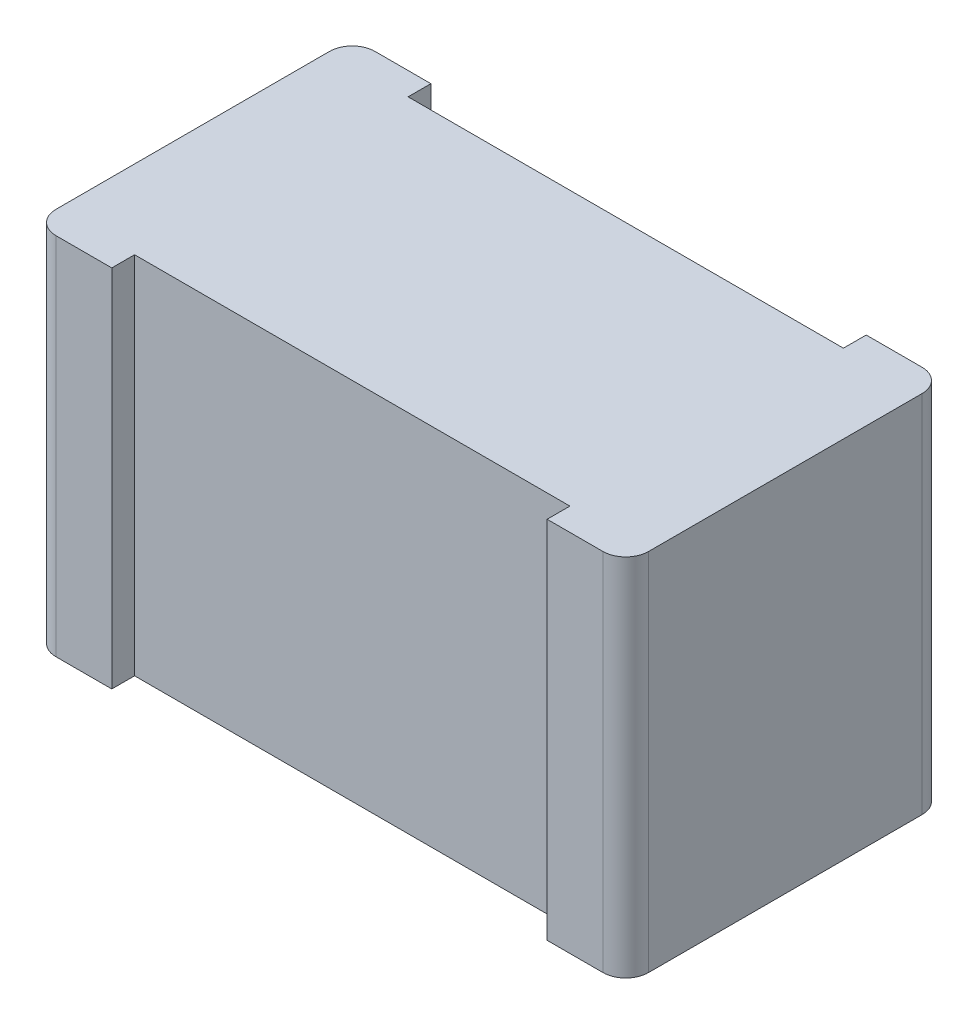
ISO-10303-21;
HEADER;
FILE_DESCRIPTION(('STEP AP214'),'2;1');
FILE_NAME('part.step','',(''),(''),'','','');
FILE_SCHEMA(('AUTOMOTIVE_DESIGN { 1 0 10303 214 1 1 1 1 }'));
ENDSEC;
DATA;
#1=APPLICATION_CONTEXT('core data for automotive mechanical design processes');
#2=APPLICATION_PROTOCOL_DEFINITION('international standard','automotive_design',2000,#1);
#3=PRODUCT_CONTEXT('',#1,'mechanical');
#4=PRODUCT('Part','Part','',(#3));
#5=PRODUCT_RELATED_PRODUCT_CATEGORY('part','',(#4));
#6=PRODUCT_DEFINITION_FORMATION('','',#4);
#7=PRODUCT_DEFINITION_CONTEXT('part definition',#1,'design');
#8=PRODUCT_DEFINITION('design','',#6,#7);
#9=PRODUCT_DEFINITION_SHAPE('','',#8);
#10=(LENGTH_UNIT() NAMED_UNIT(*) SI_UNIT(.MILLI.,.METRE.));
#11=(NAMED_UNIT(*) PLANE_ANGLE_UNIT() SI_UNIT($,.RADIAN.));
#12=(NAMED_UNIT(*) SI_UNIT($,.STERADIAN.) SOLID_ANGLE_UNIT());
#13=UNCERTAINTY_MEASURE_WITH_UNIT(LENGTH_MEASURE(1.E-05),#10,'distance_accuracy_value','');
#14=(GEOMETRIC_REPRESENTATION_CONTEXT(3) GLOBAL_UNCERTAINTY_ASSIGNED_CONTEXT((#13)) GLOBAL_UNIT_ASSIGNED_CONTEXT((#10,
#11,#12)) REPRESENTATION_CONTEXT('',''));
#15=CARTESIAN_POINT('',(0.,0.,0.));
#16=DIRECTION('',(0.,0.,1.));
#17=DIRECTION('',(1.,0.,0.));
#18=AXIS2_PLACEMENT_3D('',#15,#16,#17);
#19=CARTESIAN_POINT('',(0.,0.,7.));
#20=DIRECTION('',(0.,0.,1.));
#21=DIRECTION('',(1.,0.,0.));
#22=AXIS2_PLACEMENT_3D('',#19,#20,#21);
#23=PLANE('',#22);
#24=DIRECTION('',(0.,1.,0.));
#25=VECTOR('',#24,1.);
#26=CARTESIAN_POINT('',(4.775,4.,7.));
#27=LINE('',#26,#25);
#28=CARTESIAN_POINT('',(4.775,4.,7.));
#29=VERTEX_POINT('',#28);
#30=CARTESIAN_POINT('',(4.775,-4.,7.));
#31=VERTEX_POINT('',#30);
#32=EDGE_CURVE('E162',#29,#31,#27,.F.);
#33=ORIENTED_EDGE('',*,*,#32,.T.);
#34=DIRECTION('',(1.,0.,0.));
#35=VECTOR('',#34,1.);
#36=CARTESIAN_POINT('',(0.,-4.,7.));
#37=LINE('',#36,#35);
#38=CARTESIAN_POINT('',(6.,-4.,7.));
#39=VERTEX_POINT('',#38);
#40=EDGE_CURVE('E184',#31,#39,#37,.T.);
#41=ORIENTED_EDGE('',*,*,#40,.T.);
#42=DIRECTION('',(0.,-1.,0.));
#43=VECTOR('',#42,1.);
#44=CARTESIAN_POINT('',(6.,2.,7.));
#45=LINE('',#44,#43);
#46=CARTESIAN_POINT('',(6.,4.,7.));
#47=VERTEX_POINT('',#46);
#48=EDGE_CURVE('E151',#47,#39,#45,.T.);
#49=ORIENTED_EDGE('',*,*,#48,.F.);
#50=DIRECTION('',(1.,0.,0.));
#51=VECTOR('',#50,1.);
#52=CARTESIAN_POINT('',(0.,4.,7.));
#53=LINE('',#52,#51);
#54=EDGE_CURVE('E186',#47,#29,#53,.F.);
#55=ORIENTED_EDGE('',*,*,#54,.T.);
#56=EDGE_LOOP('',(#33,#41,#49,#55));
#57=FACE_BOUND('',#56,.T.);
#58=ADVANCED_FACE('F17',(#57),#23,.T.);
#59=CARTESIAN_POINT('',(0.,0.,0.));
#60=DIRECTION('',(0.,0.,1.));
#61=DIRECTION('',(1.,0.,0.));
#62=AXIS2_PLACEMENT_3D('',#59,#60,#61);
#63=PLANE('',#62);
#64=DIRECTION('',(1.,0.,0.));
#65=VECTOR('',#64,1.);
#66=CARTESIAN_POINT('',(0.,-4.,0.));
#67=LINE('',#66,#65);
#68=CARTESIAN_POINT('',(4.775,-4.,0.));
#69=VERTEX_POINT('',#68);
#70=CARTESIAN_POINT('',(6.,-4.,0.));
#71=VERTEX_POINT('',#70);
#72=EDGE_CURVE('E124',#69,#71,#67,.T.);
#73=ORIENTED_EDGE('',*,*,#72,.F.);
#74=DIRECTION('',(0.,1.,0.));
#75=VECTOR('',#74,1.);
#76=CARTESIAN_POINT('',(4.775,4.,0.));
#77=LINE('',#76,#75);
#78=CARTESIAN_POINT('',(4.775,4.,0.));
#79=VERTEX_POINT('',#78);
#80=EDGE_CURVE('E155',#69,#79,#77,.T.);
#81=ORIENTED_EDGE('',*,*,#80,.T.);
#82=DIRECTION('',(1.,0.,0.));
#83=VECTOR('',#82,1.);
#84=CARTESIAN_POINT('',(0.,4.,0.));
#85=LINE('',#84,#83);
#86=CARTESIAN_POINT('',(6.,4.,0.));
#87=VERTEX_POINT('',#86);
#88=EDGE_CURVE('E69',#87,#79,#85,.F.);
#89=ORIENTED_EDGE('',*,*,#88,.F.);
#90=DIRECTION('',(0.,-1.,0.));
#91=VECTOR('',#90,1.);
#92=CARTESIAN_POINT('',(6.,2.,0.));
#93=LINE('',#92,#91);
#94=EDGE_CURVE('E158',#71,#87,#93,.F.);
#95=ORIENTED_EDGE('',*,*,#94,.F.);
#96=EDGE_LOOP('',(#73,#81,#89,#95));
#97=FACE_BOUND('',#96,.T.);
#98=ADVANCED_FACE('F315',(#97),#63,.F.);
#99=CARTESIAN_POINT('',(0.,0.,7.));
#100=DIRECTION('',(0.,0.,1.));
#101=DIRECTION('',(1.,0.,0.));
#102=AXIS2_PLACEMENT_3D('',#99,#100,#101);
#103=PLANE('',#102);
#104=DIRECTION('',(0.,1.,0.));
#105=VECTOR('',#104,1.);
#106=CARTESIAN_POINT('',(-4.775,4.,7.));
#107=LINE('',#106,#105);
#108=CARTESIAN_POINT('',(-4.775,-4.,7.));
#109=VERTEX_POINT('',#108);
#110=CARTESIAN_POINT('',(-4.775,4.,7.));
#111=VERTEX_POINT('',#110);
#112=EDGE_CURVE('E176',#109,#111,#107,.T.);
#113=ORIENTED_EDGE('',*,*,#112,.T.);
#114=DIRECTION('',(1.,0.,0.));
#115=VECTOR('',#114,1.);
#116=CARTESIAN_POINT('',(0.,4.,7.));
#117=LINE('',#116,#115);
#118=CARTESIAN_POINT('',(-6.,4.,7.));
#119=VERTEX_POINT('',#118);
#120=EDGE_CURVE('E123',#111,#119,#117,.F.);
#121=ORIENTED_EDGE('',*,*,#120,.T.);
#122=DIRECTION('',(0.,1.,0.));
#123=VECTOR('',#122,1.);
#124=CARTESIAN_POINT('',(-6.,-2.,7.));
#125=LINE('',#124,#123);
#126=CARTESIAN_POINT('',(-6.,-4.,7.));
#127=VERTEX_POINT('',#126);
#128=EDGE_CURVE('E128',#127,#119,#125,.T.);
#129=ORIENTED_EDGE('',*,*,#128,.F.);
#130=DIRECTION('',(1.,0.,0.));
#131=VECTOR('',#130,1.);
#132=CARTESIAN_POINT('',(0.,-4.,7.));
#133=LINE('',#132,#131);
#134=EDGE_CURVE('E109',#127,#109,#133,.T.);
#135=ORIENTED_EDGE('',*,*,#134,.T.);
#136=EDGE_LOOP('',(#113,#121,#129,#135));
#137=FACE_BOUND('',#136,.T.);
#138=ADVANCED_FACE('F129',(#137),#103,.T.);
#139=CARTESIAN_POINT('',(0.,0.,0.));
#140=DIRECTION('',(0.,0.,1.));
#141=DIRECTION('',(1.,0.,0.));
#142=AXIS2_PLACEMENT_3D('',#139,#140,#141);
#143=PLANE('',#142);
#144=DIRECTION('',(1.,0.,0.));
#145=VECTOR('',#144,1.);
#146=CARTESIAN_POINT('',(0.,4.,0.));
#147=LINE('',#146,#145);
#148=CARTESIAN_POINT('',(-4.775,4.,0.));
#149=VERTEX_POINT('',#148);
#150=CARTESIAN_POINT('',(-6.,4.,0.));
#151=VERTEX_POINT('',#150);
#152=EDGE_CURVE('E172',#149,#151,#147,.F.);
#153=ORIENTED_EDGE('',*,*,#152,.F.);
#154=DIRECTION('',(0.,1.,0.));
#155=VECTOR('',#154,1.);
#156=CARTESIAN_POINT('',(-4.775,4.,0.));
#157=LINE('',#156,#155);
#158=CARTESIAN_POINT('',(-4.775,-4.,0.));
#159=VERTEX_POINT('',#158);
#160=EDGE_CURVE('E148',#149,#159,#157,.F.);
#161=ORIENTED_EDGE('',*,*,#160,.T.);
#162=DIRECTION('',(1.,0.,0.));
#163=VECTOR('',#162,1.);
#164=CARTESIAN_POINT('',(0.,-4.,0.));
#165=LINE('',#164,#163);
#166=CARTESIAN_POINT('',(-6.,-4.,0.));
#167=VERTEX_POINT('',#166);
#168=EDGE_CURVE('E169',#167,#159,#165,.T.);
#169=ORIENTED_EDGE('',*,*,#168,.F.);
#170=DIRECTION('',(0.,1.,0.));
#171=VECTOR('',#170,1.);
#172=CARTESIAN_POINT('',(-6.,-2.,0.));
#173=LINE('',#172,#171);
#174=EDGE_CURVE('E138',#151,#167,#173,.F.);
#175=ORIENTED_EDGE('',*,*,#174,.F.);
#176=EDGE_LOOP('',(#153,#161,#169,#175));
#177=FACE_BOUND('',#176,.T.);
#178=ADVANCED_FACE('F323',(#177),#143,.F.);
#179=CARTESIAN_POINT('',(-4.775,4.,6.5));
#180=DIRECTION('',(-1.,0.,0.));
#181=DIRECTION('',(0.,0.,1.));
#182=AXIS2_PLACEMENT_3D('',#179,#180,#181);
#183=PLANE('',#182);
#184=DIRECTION('',(0.,1.,0.));
#185=VECTOR('',#184,1.);
#186=CARTESIAN_POINT('',(-4.775,4.,6.5));
#187=LINE('',#186,#185);
#188=CARTESIAN_POINT('',(-4.775,-4.,6.5));
#189=VERTEX_POINT('',#188);
#190=CARTESIAN_POINT('',(-4.775,4.,6.5));
#191=VERTEX_POINT('',#190);
#192=EDGE_CURVE('E222',#189,#191,#187,.T.);
#193=ORIENTED_EDGE('',*,*,#192,.T.);
#194=DIRECTION('',(0.,0.,1.));
#195=VECTOR('',#194,1.);
#196=CARTESIAN_POINT('',(-4.775,4.,6.5));
#197=LINE('',#196,#195);
#198=EDGE_CURVE('E214',#111,#191,#197,.F.);
#199=ORIENTED_EDGE('',*,*,#198,.F.);
#200=ORIENTED_EDGE('',*,*,#112,.F.);
#201=DIRECTION('',(0.,0.,-1.));
#202=VECTOR('',#201,1.);
#203=CARTESIAN_POINT('',(-4.775,-4.,0.));
#204=LINE('',#203,#202);
#205=EDGE_CURVE('E119',#189,#109,#204,.F.);
#206=ORIENTED_EDGE('',*,*,#205,.F.);
#207=EDGE_LOOP('',(#193,#199,#200,#206));
#208=FACE_BOUND('',#207,.T.);
#209=ADVANCED_FACE('F332',(#208),#183,.F.);
#210=CARTESIAN_POINT('',(4.775,4.,7.));
#211=DIRECTION('',(1.,0.,0.));
#212=DIRECTION('',(0.,0.,-1.));
#213=AXIS2_PLACEMENT_3D('',#210,#211,#212);
#214=PLANE('',#213);
#215=ORIENTED_EDGE('',*,*,#32,.F.);
#216=DIRECTION('',(0.,0.,-1.));
#217=VECTOR('',#216,1.);
#218=CARTESIAN_POINT('',(4.775,4.,7.));
#219=LINE('',#218,#217);
#220=CARTESIAN_POINT('',(4.775,4.,6.5));
#221=VERTEX_POINT('',#220);
#222=EDGE_CURVE('E76',#221,#29,#219,.F.);
#223=ORIENTED_EDGE('',*,*,#222,.F.);
#224=DIRECTION('',(0.,1.,0.));
#225=VECTOR('',#224,1.);
#226=CARTESIAN_POINT('',(4.775,4.,6.5));
#227=LINE('',#226,#225);
#228=CARTESIAN_POINT('',(4.775,-4.,6.5));
#229=VERTEX_POINT('',#228);
#230=EDGE_CURVE('E273',#221,#229,#227,.F.);
#231=ORIENTED_EDGE('',*,*,#230,.T.);
#232=DIRECTION('',(0.,0.,-1.));
#233=VECTOR('',#232,1.);
#234=CARTESIAN_POINT('',(4.775,-4.,0.));
#235=LINE('',#234,#233);
#236=EDGE_CURVE('E223',#31,#229,#235,.T.);
#237=ORIENTED_EDGE('',*,*,#236,.F.);
#238=EDGE_LOOP('',(#215,#223,#231,#237));
#239=FACE_BOUND('',#238,.T.);
#240=ADVANCED_FACE('F342',(#239),#214,.F.);
#241=CARTESIAN_POINT('',(6.,2.,0.5));
#242=DIRECTION('',(0.,-1.,0.));
#243=DIRECTION('',(0.,0.,-1.));
#244=AXIS2_PLACEMENT_3D('',#241,#242,#243);
#245=CYLINDRICAL_SURFACE('',#244,0.5);
#246=CARTESIAN_POINT('',(6.,4.,0.5));
#247=DIRECTION('',(0.,-1.,0.));
#248=DIRECTION('',(0.,0.,-1.));
#249=AXIS2_PLACEMENT_3D('',#246,#247,#248);
#250=CIRCLE('',#249,0.5);
#251=CARTESIAN_POINT('',(6.5,4.,0.5));
#252=VERTEX_POINT('',#251);
#253=EDGE_CURVE('E20',#87,#252,#250,.T.);
#254=ORIENTED_EDGE('',*,*,#253,.T.);
#255=DIRECTION('',(0.,1.,0.));
#256=VECTOR('',#255,1.);
#257=CARTESIAN_POINT('',(6.5,4.,0.5));
#258=LINE('',#257,#256);
#259=CARTESIAN_POINT('',(6.5,-4.,0.5));
#260=VERTEX_POINT('',#259);
#261=EDGE_CURVE('E258',#260,#252,#258,.T.);
#262=ORIENTED_EDGE('',*,*,#261,.F.);
#263=CARTESIAN_POINT('',(6.,-4.,0.5));
#264=DIRECTION('',(0.,-1.,0.));
#265=DIRECTION('',(0.,0.,-1.));
#266=AXIS2_PLACEMENT_3D('',#263,#264,#265);
#267=CIRCLE('',#266,0.5);
#268=EDGE_CURVE('E231',#71,#260,#267,.T.);
#269=ORIENTED_EDGE('',*,*,#268,.F.);
#270=ORIENTED_EDGE('',*,*,#94,.T.);
#271=EDGE_LOOP('',(#254,#262,#269,#270));
#272=FACE_BOUND('',#271,.T.);
#273=ADVANCED_FACE('F348',(#272),#245,.T.);
#274=CARTESIAN_POINT('',(6.,2.,6.5));
#275=DIRECTION('',(0.,-1.,0.));
#276=DIRECTION('',(0.,0.,-1.));
#277=AXIS2_PLACEMENT_3D('',#274,#275,#276);
#278=CYLINDRICAL_SURFACE('',#277,0.5);
#279=CARTESIAN_POINT('',(6.,4.,6.5));
#280=DIRECTION('',(0.,-1.,0.));
#281=DIRECTION('',(0.,0.,-1.));
#282=AXIS2_PLACEMENT_3D('',#279,#280,#281);
#283=CIRCLE('',#282,0.5);
#284=CARTESIAN_POINT('',(6.5,4.,6.5));
#285=VERTEX_POINT('',#284);
#286=EDGE_CURVE('E149',#285,#47,#283,.T.);
#287=ORIENTED_EDGE('',*,*,#286,.T.);
#288=ORIENTED_EDGE('',*,*,#48,.T.);
#289=CARTESIAN_POINT('',(6.,-4.,6.5));
#290=DIRECTION('',(0.,-1.,0.));
#291=DIRECTION('',(0.,0.,-1.));
#292=AXIS2_PLACEMENT_3D('',#289,#290,#291);
#293=CIRCLE('',#292,0.5);
#294=CARTESIAN_POINT('',(6.5,-4.,6.5));
#295=VERTEX_POINT('',#294);
#296=EDGE_CURVE('E242',#295,#39,#293,.T.);
#297=ORIENTED_EDGE('',*,*,#296,.F.);
#298=DIRECTION('',(0.,1.,0.));
#299=VECTOR('',#298,1.);
#300=CARTESIAN_POINT('',(6.5,4.,6.5));
#301=LINE('',#300,#299);
#302=EDGE_CURVE('E260',#285,#295,#301,.F.);
#303=ORIENTED_EDGE('',*,*,#302,.F.);
#304=EDGE_LOOP('',(#287,#288,#297,#303));
#305=FACE_BOUND('',#304,.T.);
#306=ADVANCED_FACE('F346',(#305),#278,.T.);
#307=CARTESIAN_POINT('',(4.775,4.,0.500000000000001));
#308=DIRECTION('',(1.,0.,0.));
#309=DIRECTION('',(0.,0.,-1.));
#310=AXIS2_PLACEMENT_3D('',#307,#308,#309);
#311=PLANE('',#310);
#312=DIRECTION('',(0.,1.,0.));
#313=VECTOR('',#312,1.);
#314=CARTESIAN_POINT('',(4.775,4.,0.500000000000001));
#315=LINE('',#314,#313);
#316=CARTESIAN_POINT('',(4.775,-4.,0.500000000000001));
#317=VERTEX_POINT('',#316);
#318=CARTESIAN_POINT('',(4.775,4.,0.500000000000001));
#319=VERTEX_POINT('',#318);
#320=EDGE_CURVE('E261',#317,#319,#315,.T.);
#321=ORIENTED_EDGE('',*,*,#320,.T.);
#322=DIRECTION('',(0.,0.,-1.));
#323=VECTOR('',#322,1.);
#324=CARTESIAN_POINT('',(4.775,4.,0.500000000000001));
#325=LINE('',#324,#323);
#326=EDGE_CURVE('E201',#79,#319,#325,.F.);
#327=ORIENTED_EDGE('',*,*,#326,.F.);
#328=ORIENTED_EDGE('',*,*,#80,.F.);
#329=DIRECTION('',(0.,0.,-1.));
#330=VECTOR('',#329,1.);
#331=CARTESIAN_POINT('',(4.775,-4.,0.));
#332=LINE('',#331,#330);
#333=EDGE_CURVE('E210',#317,#69,#332,.T.);
#334=ORIENTED_EDGE('',*,*,#333,.F.);
#335=EDGE_LOOP('',(#321,#327,#328,#334));
#336=FACE_BOUND('',#335,.T.);
#337=ADVANCED_FACE('F317',(#336),#311,.F.);
#338=CARTESIAN_POINT('',(-4.775,4.,0.));
#339=DIRECTION('',(-1.,0.,0.));
#340=DIRECTION('',(0.,0.,1.));
#341=AXIS2_PLACEMENT_3D('',#338,#339,#340);
#342=PLANE('',#341);
#343=ORIENTED_EDGE('',*,*,#160,.F.);
#344=DIRECTION('',(0.,0.,1.));
#345=VECTOR('',#344,1.);
#346=CARTESIAN_POINT('',(-4.775,4.,0.));
#347=LINE('',#346,#345);
#348=CARTESIAN_POINT('',(-4.775,4.,0.500000000000001));
#349=VERTEX_POINT('',#348);
#350=EDGE_CURVE('E198',#349,#149,#347,.F.);
#351=ORIENTED_EDGE('',*,*,#350,.F.);
#352=DIRECTION('',(0.,1.,0.));
#353=VECTOR('',#352,1.);
#354=CARTESIAN_POINT('',(-4.775,4.,0.500000000000001));
#355=LINE('',#354,#353);
#356=CARTESIAN_POINT('',(-4.775,-4.,0.500000000000001));
#357=VERTEX_POINT('',#356);
#358=EDGE_CURVE('E263',#349,#357,#355,.F.);
#359=ORIENTED_EDGE('',*,*,#358,.T.);
#360=DIRECTION('',(0.,0.,-1.));
#361=VECTOR('',#360,1.);
#362=CARTESIAN_POINT('',(-4.775,-4.,0.));
#363=LINE('',#362,#361);
#364=EDGE_CURVE('E141',#159,#357,#363,.F.);
#365=ORIENTED_EDGE('',*,*,#364,.F.);
#366=EDGE_LOOP('',(#343,#351,#359,#365));
#367=FACE_BOUND('',#366,.T.);
#368=ADVANCED_FACE('F321',(#367),#342,.F.);
#369=CARTESIAN_POINT('',(-6.,-2.,6.5));
#370=DIRECTION('',(0.,1.,0.));
#371=DIRECTION('',(0.,0.,1.));
#372=AXIS2_PLACEMENT_3D('',#369,#370,#371);
#373=CYLINDRICAL_SURFACE('',#372,0.5);
#374=CARTESIAN_POINT('',(-6.,-4.,6.5));
#375=DIRECTION('',(0.,1.,0.));
#376=DIRECTION('',(0.,0.,1.));
#377=AXIS2_PLACEMENT_3D('',#374,#375,#376);
#378=CIRCLE('',#377,0.5);
#379=CARTESIAN_POINT('',(-6.5,-4.,6.5));
#380=VERTEX_POINT('',#379);
#381=EDGE_CURVE('E114',#127,#380,#378,.F.);
#382=ORIENTED_EDGE('',*,*,#381,.F.);
#383=ORIENTED_EDGE('',*,*,#128,.T.);
#384=CARTESIAN_POINT('',(-6.,4.,6.5));
#385=DIRECTION('',(0.,1.,0.));
#386=DIRECTION('',(0.,0.,1.));
#387=AXIS2_PLACEMENT_3D('',#384,#385,#386);
#388=CIRCLE('',#387,0.5);
#389=CARTESIAN_POINT('',(-6.5,4.,6.5));
#390=VERTEX_POINT('',#389);
#391=EDGE_CURVE('E131',#119,#390,#388,.F.);
#392=ORIENTED_EDGE('',*,*,#391,.T.);
#393=DIRECTION('',(0.,1.,0.));
#394=VECTOR('',#393,1.);
#395=CARTESIAN_POINT('',(-6.5,-4.,6.5));
#396=LINE('',#395,#394);
#397=EDGE_CURVE('E136',#380,#390,#396,.T.);
#398=ORIENTED_EDGE('',*,*,#397,.F.);
#399=EDGE_LOOP('',(#382,#383,#392,#398));
#400=FACE_BOUND('',#399,.T.);
#401=ADVANCED_FACE('F134',(#400),#373,.T.);
#402=CARTESIAN_POINT('',(-6.,-2.,0.5));
#403=DIRECTION('',(0.,1.,0.));
#404=DIRECTION('',(0.,0.,1.));
#405=AXIS2_PLACEMENT_3D('',#402,#403,#404);
#406=CYLINDRICAL_SURFACE('',#405,0.5);
#407=CARTESIAN_POINT('',(-6.,-4.,0.5));
#408=DIRECTION('',(0.,1.,0.));
#409=DIRECTION('',(0.,0.,1.));
#410=AXIS2_PLACEMENT_3D('',#407,#408,#409);
#411=CIRCLE('',#410,0.5);
#412=CARTESIAN_POINT('',(-6.5,-4.,0.5));
#413=VERTEX_POINT('',#412);
#414=EDGE_CURVE('E137',#413,#167,#411,.F.);
#415=ORIENTED_EDGE('',*,*,#414,.F.);
#416=DIRECTION('',(0.,1.,0.));
#417=VECTOR('',#416,1.);
#418=CARTESIAN_POINT('',(-6.5,-4.,0.5));
#419=LINE('',#418,#417);
#420=CARTESIAN_POINT('',(-6.5,4.,0.5));
#421=VERTEX_POINT('',#420);
#422=EDGE_CURVE('E270',#421,#413,#419,.F.);
#423=ORIENTED_EDGE('',*,*,#422,.F.);
#424=CARTESIAN_POINT('',(-6.,4.,0.5));
#425=DIRECTION('',(0.,1.,0.));
#426=DIRECTION('',(0.,0.,1.));
#427=AXIS2_PLACEMENT_3D('',#424,#425,#426);
#428=CIRCLE('',#427,0.5);
#429=EDGE_CURVE('E34',#421,#151,#428,.F.);
#430=ORIENTED_EDGE('',*,*,#429,.T.);
#431=ORIENTED_EDGE('',*,*,#174,.T.);
#432=EDGE_LOOP('',(#415,#423,#430,#431));
#433=FACE_BOUND('',#432,.T.);
#434=ADVANCED_FACE('F326',(#433),#406,.T.);
#435=CARTESIAN_POINT('',(6.5,-4.,0.));
#436=DIRECTION('',(0.,-1.,0.));
#437=DIRECTION('',(0.,0.,-1.));
#438=AXIS2_PLACEMENT_3D('',#435,#436,#437);
#439=PLANE('',#438);
#440=ORIENTED_EDGE('',*,*,#205,.T.);
#441=ORIENTED_EDGE('',*,*,#134,.F.);
#442=ORIENTED_EDGE('',*,*,#381,.T.);
#443=DIRECTION('',(0.,0.,1.));
#444=VECTOR('',#443,1.);
#445=CARTESIAN_POINT('',(-6.5,-4.,0.));
#446=LINE('',#445,#444);
#447=EDGE_CURVE('E267',#413,#380,#446,.T.);
#448=ORIENTED_EDGE('',*,*,#447,.F.);
#449=ORIENTED_EDGE('',*,*,#414,.T.);
#450=ORIENTED_EDGE('',*,*,#168,.T.);
#451=ORIENTED_EDGE('',*,*,#364,.T.);
#452=DIRECTION('',(1.,0.,0.));
#453=VECTOR('',#452,1.);
#454=CARTESIAN_POINT('',(-4.775,-4.,0.500000000000001));
#455=LINE('',#454,#453);
#456=EDGE_CURVE('E281',#357,#317,#455,.T.);
#457=ORIENTED_EDGE('',*,*,#456,.T.);
#458=ORIENTED_EDGE('',*,*,#333,.T.);
#459=ORIENTED_EDGE('',*,*,#72,.T.);
#460=ORIENTED_EDGE('',*,*,#268,.T.);
#461=DIRECTION('',(0.,0.,-1.));
#462=VECTOR('',#461,1.);
#463=CARTESIAN_POINT('',(6.5,-4.,0.));
#464=LINE('',#463,#462);
#465=EDGE_CURVE('E252',#295,#260,#464,.T.);
#466=ORIENTED_EDGE('',*,*,#465,.F.);
#467=ORIENTED_EDGE('',*,*,#296,.T.);
#468=ORIENTED_EDGE('',*,*,#40,.F.);
#469=ORIENTED_EDGE('',*,*,#236,.T.);
#470=DIRECTION('',(-1.,0.,0.));
#471=VECTOR('',#470,1.);
#472=CARTESIAN_POINT('',(4.775,-4.,6.5));
#473=LINE('',#472,#471);
#474=EDGE_CURVE('E276',#229,#189,#473,.T.);
#475=ORIENTED_EDGE('',*,*,#474,.T.);
#476=EDGE_LOOP('',(#440,#441,#442,#448,#449,#450,#451,#457,#458,#459,#460,#466,#467,#468,#469,#475));
#477=FACE_BOUND('',#476,.T.);
#478=ADVANCED_FACE('F111',(#477),#439,.T.);
#479=CARTESIAN_POINT('',(4.775,4.,6.5));
#480=DIRECTION('',(0.,0.,-1.));
#481=DIRECTION('',(-1.,0.,0.));
#482=AXIS2_PLACEMENT_3D('',#479,#480,#481);
#483=PLANE('',#482);
#484=ORIENTED_EDGE('',*,*,#230,.F.);
#485=DIRECTION('',(1.,0.,0.));
#486=VECTOR('',#485,1.);
#487=CARTESIAN_POINT('',(-6.5,4.,6.5));
#488=LINE('',#487,#486);
#489=EDGE_CURVE('E269',#191,#221,#488,.T.);
#490=ORIENTED_EDGE('',*,*,#489,.F.);
#491=ORIENTED_EDGE('',*,*,#192,.F.);
#492=ORIENTED_EDGE('',*,*,#474,.F.);
#493=EDGE_LOOP('',(#484,#490,#491,#492));
#494=FACE_BOUND('',#493,.T.);
#495=ADVANCED_FACE('F338',(#494),#483,.F.);
#496=CARTESIAN_POINT('',(6.5,4.,0.));
#497=DIRECTION('',(1.,0.,0.));
#498=DIRECTION('',(0.,0.,-1.));
#499=AXIS2_PLACEMENT_3D('',#496,#497,#498);
#500=PLANE('',#499);
#501=ORIENTED_EDGE('',*,*,#302,.T.);
#502=ORIENTED_EDGE('',*,*,#465,.T.);
#503=ORIENTED_EDGE('',*,*,#261,.T.);
#504=DIRECTION('',(0.,0.,1.));
#505=VECTOR('',#504,1.);
#506=CARTESIAN_POINT('',(6.5,4.,0.));
#507=LINE('',#506,#505);
#508=EDGE_CURVE('E288',#285,#252,#507,.F.);
#509=ORIENTED_EDGE('',*,*,#508,.F.);
#510=EDGE_LOOP('',(#501,#502,#503,#509));
#511=FACE_BOUND('',#510,.T.);
#512=ADVANCED_FACE('F256',(#511),#500,.T.);
#513=CARTESIAN_POINT('',(-4.775,4.,0.500000000000001));
#514=DIRECTION('',(0.,0.,1.));
#515=DIRECTION('',(1.,0.,0.));
#516=AXIS2_PLACEMENT_3D('',#513,#514,#515);
#517=PLANE('',#516);
#518=ORIENTED_EDGE('',*,*,#358,.F.);
#519=DIRECTION('',(1.,0.,0.));
#520=VECTOR('',#519,1.);
#521=CARTESIAN_POINT('',(-6.5,4.,0.500000000000001));
#522=LINE('',#521,#520);
#523=EDGE_CURVE('E26',#319,#349,#522,.F.);
#524=ORIENTED_EDGE('',*,*,#523,.F.);
#525=ORIENTED_EDGE('',*,*,#320,.F.);
#526=ORIENTED_EDGE('',*,*,#456,.F.);
#527=EDGE_LOOP('',(#518,#524,#525,#526));
#528=FACE_BOUND('',#527,.T.);
#529=ADVANCED_FACE('F298',(#528),#517,.F.);
#530=CARTESIAN_POINT('',(-6.5,-4.,0.));
#531=DIRECTION('',(-1.,0.,0.));
#532=DIRECTION('',(0.,0.,1.));
#533=AXIS2_PLACEMENT_3D('',#530,#531,#532);
#534=PLANE('',#533);
#535=ORIENTED_EDGE('',*,*,#422,.T.);
#536=ORIENTED_EDGE('',*,*,#447,.T.);
#537=ORIENTED_EDGE('',*,*,#397,.T.);
#538=DIRECTION('',(0.,0.,1.));
#539=VECTOR('',#538,1.);
#540=CARTESIAN_POINT('',(-6.5,4.,0.));
#541=LINE('',#540,#539);
#542=EDGE_CURVE('E11',#421,#390,#541,.T.);
#543=ORIENTED_EDGE('',*,*,#542,.F.);
#544=EDGE_LOOP('',(#535,#536,#537,#543));
#545=FACE_BOUND('',#544,.T.);
#546=ADVANCED_FACE('F329',(#545),#534,.T.);
#547=CARTESIAN_POINT('',(-6.5,4.,0.));
#548=DIRECTION('',(0.,1.,0.));
#549=DIRECTION('',(0.,0.,1.));
#550=AXIS2_PLACEMENT_3D('',#547,#548,#549);
#551=PLANE('',#550);
#552=ORIENTED_EDGE('',*,*,#429,.F.);
#553=ORIENTED_EDGE('',*,*,#542,.T.);
#554=ORIENTED_EDGE('',*,*,#391,.F.);
#555=ORIENTED_EDGE('',*,*,#120,.F.);
#556=ORIENTED_EDGE('',*,*,#198,.T.);
#557=ORIENTED_EDGE('',*,*,#489,.T.);
#558=ORIENTED_EDGE('',*,*,#222,.T.);
#559=ORIENTED_EDGE('',*,*,#54,.F.);
#560=ORIENTED_EDGE('',*,*,#286,.F.);
#561=ORIENTED_EDGE('',*,*,#508,.T.);
#562=ORIENTED_EDGE('',*,*,#253,.F.);
#563=ORIENTED_EDGE('',*,*,#88,.T.);
#564=ORIENTED_EDGE('',*,*,#326,.T.);
#565=ORIENTED_EDGE('',*,*,#523,.T.);
#566=ORIENTED_EDGE('',*,*,#350,.T.);
#567=ORIENTED_EDGE('',*,*,#152,.T.);
#568=EDGE_LOOP('',(#552,#553,#554,#555,#556,#557,#558,#559,#560,#561,#562,#563,#564,#565,#566,#567));
#569=FACE_BOUND('',#568,.T.);
#570=ADVANCED_FACE('F292',(#569),#551,.T.);
#571=CLOSED_SHELL('',(#58,#98,#138,#178,#209,#240,#273,#306,#337,#368,#401,#434,#478,#495,#512,
#529,#546,#570));
#572=MANIFOLD_SOLID_BREP('B1',#571);
#573=ADVANCED_BREP_SHAPE_REPRESENTATION('',(#18,#572),#14);
#574=SHAPE_DEFINITION_REPRESENTATION(#9,#573);
ENDSEC;
END-ISO-10303-21;
